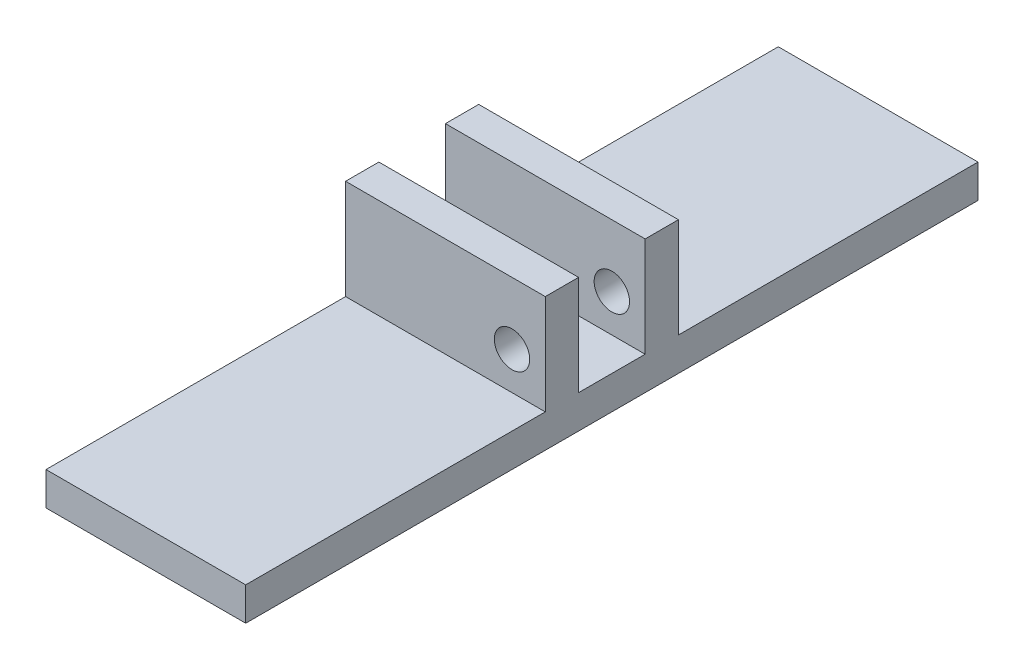
ISO-10303-21;
HEADER;
FILE_DESCRIPTION(('STEP AP214'),'2;1');
FILE_NAME('part.step','',(''),(''),'','','');
FILE_SCHEMA(('AUTOMOTIVE_DESIGN { 1 0 10303 214 1 1 1 1 }'));
ENDSEC;
DATA;
#1=APPLICATION_CONTEXT('core data for automotive mechanical design processes');
#2=APPLICATION_PROTOCOL_DEFINITION('international standard','automotive_design',2000,#1);
#3=PRODUCT_CONTEXT('',#1,'mechanical');
#4=PRODUCT('Part','Part','',(#3));
#5=PRODUCT_RELATED_PRODUCT_CATEGORY('part','',(#4));
#6=PRODUCT_DEFINITION_FORMATION('','',#4);
#7=PRODUCT_DEFINITION_CONTEXT('part definition',#1,'design');
#8=PRODUCT_DEFINITION('design','',#6,#7);
#9=PRODUCT_DEFINITION_SHAPE('','',#8);
#10=(LENGTH_UNIT() NAMED_UNIT(*) SI_UNIT(.MILLI.,.METRE.));
#11=(NAMED_UNIT(*) PLANE_ANGLE_UNIT() SI_UNIT($,.RADIAN.));
#12=(NAMED_UNIT(*) SI_UNIT($,.STERADIAN.) SOLID_ANGLE_UNIT());
#13=UNCERTAINTY_MEASURE_WITH_UNIT(LENGTH_MEASURE(1.E-05),#10,'distance_accuracy_value','');
#14=(GEOMETRIC_REPRESENTATION_CONTEXT(3) GLOBAL_UNCERTAINTY_ASSIGNED_CONTEXT((#13)) GLOBAL_UNIT_ASSIGNED_CONTEXT((#10,
#11,#12)) REPRESENTATION_CONTEXT('',''));
#15=CARTESIAN_POINT('',(0.,0.,0.));
#16=DIRECTION('',(0.,0.,1.));
#17=DIRECTION('',(1.,0.,0.));
#18=AXIS2_PLACEMENT_3D('',#15,#16,#17);
#19=CARTESIAN_POINT('',(38.1,6.35,69.85));
#20=DIRECTION('',(0.,0.,-1.));
#21=DIRECTION('',(-1.,0.,0.));
#22=AXIS2_PLACEMENT_3D('',#19,#20,#21);
#23=PLANE('',#22);
#24=DIRECTION('',(0.,-1.,0.));
#25=VECTOR('',#24,1.);
#26=CARTESIAN_POINT('',(0.,6.35,69.85));
#27=LINE('',#26,#25);
#28=CARTESIAN_POINT('',(0.,6.35,69.85));
#29=VERTEX_POINT('',#28);
#30=CARTESIAN_POINT('',(0.,0.,69.85));
#31=VERTEX_POINT('',#30);
#32=EDGE_CURVE('E154',#29,#31,#27,.T.);
#33=ORIENTED_EDGE('',*,*,#32,.T.);
#34=DIRECTION('',(-1.,0.,0.));
#35=VECTOR('',#34,1.);
#36=CARTESIAN_POINT('',(38.1,0.,69.85));
#37=LINE('',#36,#35);
#38=CARTESIAN_POINT('',(38.1,0.,69.85));
#39=VERTEX_POINT('',#38);
#40=EDGE_CURVE('E11',#39,#31,#37,.T.);
#41=ORIENTED_EDGE('',*,*,#40,.F.);
#42=DIRECTION('',(0.,-1.,0.));
#43=VECTOR('',#42,1.);
#44=CARTESIAN_POINT('',(38.1,6.35,69.85));
#45=LINE('',#44,#43);
#46=CARTESIAN_POINT('',(38.1,6.35,69.85));
#47=VERTEX_POINT('',#46);
#48=EDGE_CURVE('E177',#47,#39,#45,.T.);
#49=ORIENTED_EDGE('',*,*,#48,.F.);
#50=DIRECTION('',(-1.,0.,0.));
#51=VECTOR('',#50,1.);
#52=CARTESIAN_POINT('',(38.1,6.35,69.85));
#53=LINE('',#52,#51);
#54=EDGE_CURVE('E150',#47,#29,#53,.T.);
#55=ORIENTED_EDGE('',*,*,#54,.T.);
#56=EDGE_LOOP('',(#33,#41,#49,#55));
#57=FACE_BOUND('',#56,.T.);
#58=ADVANCED_FACE('F33',(#57),#23,.F.);
#59=CARTESIAN_POINT('',(38.1,0.,69.85));
#60=DIRECTION('',(0.,1.,0.));
#61=DIRECTION('',(0.,0.,1.));
#62=AXIS2_PLACEMENT_3D('',#59,#60,#61);
#63=PLANE('',#62);
#64=DIRECTION('',(0.,0.,-1.));
#65=VECTOR('',#64,1.);
#66=CARTESIAN_POINT('',(0.,0.,69.85));
#67=LINE('',#66,#65);
#68=CARTESIAN_POINT('',(0.,0.,-69.85));
#69=VERTEX_POINT('',#68);
#70=EDGE_CURVE('E157',#31,#69,#67,.T.);
#71=ORIENTED_EDGE('',*,*,#70,.T.);
#72=DIRECTION('',(-1.,0.,0.));
#73=VECTOR('',#72,1.);
#74=CARTESIAN_POINT('',(38.1,0.,-69.85));
#75=LINE('',#74,#73);
#76=CARTESIAN_POINT('',(38.1,0.,-69.85));
#77=VERTEX_POINT('',#76);
#78=EDGE_CURVE('E42',#77,#69,#75,.T.);
#79=ORIENTED_EDGE('',*,*,#78,.F.);
#80=DIRECTION('',(0.,0.,-1.));
#81=VECTOR('',#80,1.);
#82=CARTESIAN_POINT('',(38.1,0.,69.85));
#83=LINE('',#82,#81);
#84=EDGE_CURVE('E105',#39,#77,#83,.T.);
#85=ORIENTED_EDGE('',*,*,#84,.F.);
#86=ORIENTED_EDGE('',*,*,#40,.T.);
#87=EDGE_LOOP('',(#71,#79,#85,#86));
#88=FACE_BOUND('',#87,.T.);
#89=ADVANCED_FACE('F257',(#88),#63,.F.);
#90=CARTESIAN_POINT('',(38.1,0.,-69.85));
#91=DIRECTION('',(0.,0.,1.));
#92=DIRECTION('',(1.,0.,0.));
#93=AXIS2_PLACEMENT_3D('',#90,#91,#92);
#94=PLANE('',#93);
#95=DIRECTION('',(0.,1.,0.));
#96=VECTOR('',#95,1.);
#97=CARTESIAN_POINT('',(0.,0.,-69.85));
#98=LINE('',#97,#96);
#99=CARTESIAN_POINT('',(0.,6.35,-69.85));
#100=VERTEX_POINT('',#99);
#101=EDGE_CURVE('E160',#69,#100,#98,.T.);
#102=ORIENTED_EDGE('',*,*,#101,.T.);
#103=DIRECTION('',(-1.,0.,0.));
#104=VECTOR('',#103,1.);
#105=CARTESIAN_POINT('',(38.1,6.35,-69.85));
#106=LINE('',#105,#104);
#107=CARTESIAN_POINT('',(38.1,6.35,-69.85));
#108=VERTEX_POINT('',#107);
#109=EDGE_CURVE('E196',#108,#100,#106,.T.);
#110=ORIENTED_EDGE('',*,*,#109,.F.);
#111=DIRECTION('',(0.,1.,0.));
#112=VECTOR('',#111,1.);
#113=CARTESIAN_POINT('',(38.1,0.,-69.85));
#114=LINE('',#113,#112);
#115=EDGE_CURVE('E205',#77,#108,#114,.T.);
#116=ORIENTED_EDGE('',*,*,#115,.F.);
#117=ORIENTED_EDGE('',*,*,#78,.T.);
#118=EDGE_LOOP('',(#102,#110,#116,#117));
#119=FACE_BOUND('',#118,.T.);
#120=ADVANCED_FACE('F203',(#119),#94,.F.);
#121=CARTESIAN_POINT('',(38.1,6.35,-69.85));
#122=DIRECTION('',(0.,-1.,0.));
#123=DIRECTION('',(0.,0.,-1.));
#124=AXIS2_PLACEMENT_3D('',#121,#122,#123);
#125=PLANE('',#124);
#126=DIRECTION('',(0.,0.,1.));
#127=VECTOR('',#126,1.);
#128=CARTESIAN_POINT('',(0.,6.35,-69.85));
#129=LINE('',#128,#127);
#130=CARTESIAN_POINT('',(0.,6.34999999999999,-12.7));
#131=VERTEX_POINT('',#130);
#132=EDGE_CURVE('E162',#100,#131,#129,.T.);
#133=ORIENTED_EDGE('',*,*,#132,.T.);
#134=DIRECTION('',(-1.,0.,0.));
#135=VECTOR('',#134,1.);
#136=CARTESIAN_POINT('',(38.1,6.34999999999999,-12.7));
#137=LINE('',#136,#135);
#138=CARTESIAN_POINT('',(38.1,6.34999999999999,-12.7));
#139=VERTEX_POINT('',#138);
#140=EDGE_CURVE('E193',#139,#131,#137,.T.);
#141=ORIENTED_EDGE('',*,*,#140,.F.);
#142=DIRECTION('',(0.,0.,1.));
#143=VECTOR('',#142,1.);
#144=CARTESIAN_POINT('',(38.1,6.35,-69.85));
#145=LINE('',#144,#143);
#146=EDGE_CURVE('E223',#108,#139,#145,.T.);
#147=ORIENTED_EDGE('',*,*,#146,.F.);
#148=ORIENTED_EDGE('',*,*,#109,.T.);
#149=EDGE_LOOP('',(#133,#141,#147,#148));
#150=FACE_BOUND('',#149,.T.);
#151=ADVANCED_FACE('F214',(#150),#125,.F.);
#152=CARTESIAN_POINT('',(38.1,6.34999999999999,-12.7));
#153=DIRECTION('',(0.,0.,1.));
#154=DIRECTION('',(0.,-1.,0.));
#155=AXIS2_PLACEMENT_3D('',#152,#153,#154);
#156=PLANE('',#155);
#157=CARTESIAN_POINT('',(31.75,13.5255,-12.7));
#158=DIRECTION('',(0.,0.,1.));
#159=DIRECTION('',(0.,-1.,0.));
#160=AXIS2_PLACEMENT_3D('',#157,#158,#159);
#161=CIRCLE('',#160,3.37819999999999);
#162=CARTESIAN_POINT('',(31.75,10.1473,-12.7));
#163=VERTEX_POINT('',#162);
#164=EDGE_CURVE('E36',#163,#163,#161,.T.);
#165=ORIENTED_EDGE('',*,*,#164,.T.);
#166=EDGE_LOOP('',(#165));
#167=FACE_BOUND('',#166,.T.);
#168=DIRECTION('',(0.,1.,0.));
#169=VECTOR('',#168,1.);
#170=CARTESIAN_POINT('',(0.,6.34999999999999,-12.7));
#171=LINE('',#170,#169);
#172=CARTESIAN_POINT('',(0.,25.4,-12.7));
#173=VERTEX_POINT('',#172);
#174=EDGE_CURVE('E164',#131,#173,#171,.T.);
#175=ORIENTED_EDGE('',*,*,#174,.T.);
#176=DIRECTION('',(-1.,0.,0.));
#177=VECTOR('',#176,1.);
#178=CARTESIAN_POINT('',(38.1,25.4,-12.7));
#179=LINE('',#178,#177);
#180=CARTESIAN_POINT('',(38.1,25.4,-12.7));
#181=VERTEX_POINT('',#180);
#182=EDGE_CURVE('E190',#181,#173,#179,.T.);
#183=ORIENTED_EDGE('',*,*,#182,.F.);
#184=DIRECTION('',(0.,1.,0.));
#185=VECTOR('',#184,1.);
#186=CARTESIAN_POINT('',(38.1,6.34999999999999,-12.7));
#187=LINE('',#186,#185);
#188=EDGE_CURVE('E220',#139,#181,#187,.T.);
#189=ORIENTED_EDGE('',*,*,#188,.F.);
#190=ORIENTED_EDGE('',*,*,#140,.T.);
#191=EDGE_LOOP('',(#175,#183,#189,#190));
#192=FACE_BOUND('',#191,.T.);
#193=ADVANCED_FACE('F218',(#167,#192),#156,.F.);
#194=CARTESIAN_POINT('',(38.1,25.4,-12.7));
#195=DIRECTION('',(0.,-1.,0.));
#196=DIRECTION('',(0.,0.,-1.));
#197=AXIS2_PLACEMENT_3D('',#194,#195,#196);
#198=PLANE('',#197);
#199=DIRECTION('',(0.,0.,1.));
#200=VECTOR('',#199,1.);
#201=CARTESIAN_POINT('',(0.,25.4,-12.7));
#202=LINE('',#201,#200);
#203=CARTESIAN_POINT('',(0.,25.4,-6.35));
#204=VERTEX_POINT('',#203);
#205=EDGE_CURVE('E166',#173,#204,#202,.T.);
#206=ORIENTED_EDGE('',*,*,#205,.T.);
#207=DIRECTION('',(-1.,0.,0.));
#208=VECTOR('',#207,1.);
#209=CARTESIAN_POINT('',(38.1,25.4,-6.35));
#210=LINE('',#209,#208);
#211=CARTESIAN_POINT('',(38.1,25.4,-6.35));
#212=VERTEX_POINT('',#211);
#213=EDGE_CURVE('E187',#212,#204,#210,.T.);
#214=ORIENTED_EDGE('',*,*,#213,.F.);
#215=DIRECTION('',(0.,0.,1.));
#216=VECTOR('',#215,1.);
#217=CARTESIAN_POINT('',(38.1,25.4,-12.7));
#218=LINE('',#217,#216);
#219=EDGE_CURVE('E222',#181,#212,#218,.T.);
#220=ORIENTED_EDGE('',*,*,#219,.F.);
#221=ORIENTED_EDGE('',*,*,#182,.T.);
#222=EDGE_LOOP('',(#206,#214,#220,#221));
#223=FACE_BOUND('',#222,.T.);
#224=ADVANCED_FACE('F270',(#223),#198,.F.);
#225=CARTESIAN_POINT('',(38.1,25.4,-6.35));
#226=DIRECTION('',(0.,0.,-1.));
#227=DIRECTION('',(0.,1.,0.));
#228=AXIS2_PLACEMENT_3D('',#225,#226,#227);
#229=PLANE('',#228);
#230=CARTESIAN_POINT('',(31.75,13.5255,-6.35));
#231=DIRECTION('',(0.,0.,-1.));
#232=DIRECTION('',(0.,1.,0.));
#233=AXIS2_PLACEMENT_3D('',#230,#231,#232);
#234=CIRCLE('',#233,3.37819999999999);
#235=CARTESIAN_POINT('',(31.75,16.9037,-6.35));
#236=VERTEX_POINT('',#235);
#237=EDGE_CURVE('E158',#236,#236,#234,.T.);
#238=ORIENTED_EDGE('',*,*,#237,.T.);
#239=EDGE_LOOP('',(#238));
#240=FACE_BOUND('',#239,.T.);
#241=DIRECTION('',(0.,-1.,0.));
#242=VECTOR('',#241,1.);
#243=CARTESIAN_POINT('',(0.,25.4,-6.35));
#244=LINE('',#243,#242);
#245=CARTESIAN_POINT('',(0.,6.34999999999999,-6.35));
#246=VERTEX_POINT('',#245);
#247=EDGE_CURVE('E168',#204,#246,#244,.T.);
#248=ORIENTED_EDGE('',*,*,#247,.T.);
#249=DIRECTION('',(-1.,0.,0.));
#250=VECTOR('',#249,1.);
#251=CARTESIAN_POINT('',(38.1,6.34999999999999,-6.35));
#252=LINE('',#251,#250);
#253=CARTESIAN_POINT('',(38.1,6.34999999999999,-6.35));
#254=VERTEX_POINT('',#253);
#255=EDGE_CURVE('E184',#254,#246,#252,.T.);
#256=ORIENTED_EDGE('',*,*,#255,.F.);
#257=DIRECTION('',(0.,-1.,0.));
#258=VECTOR('',#257,1.);
#259=CARTESIAN_POINT('',(38.1,25.4,-6.35));
#260=LINE('',#259,#258);
#261=EDGE_CURVE('E225',#212,#254,#260,.T.);
#262=ORIENTED_EDGE('',*,*,#261,.F.);
#263=ORIENTED_EDGE('',*,*,#213,.T.);
#264=EDGE_LOOP('',(#248,#256,#262,#263));
#265=FACE_BOUND('',#264,.T.);
#266=ADVANCED_FACE('F274',(#240,#265),#229,.F.);
#267=CARTESIAN_POINT('',(38.1,6.34999999999999,-6.35));
#268=DIRECTION('',(0.,-1.,0.));
#269=DIRECTION('',(0.,0.,-1.));
#270=AXIS2_PLACEMENT_3D('',#267,#268,#269);
#271=PLANE('',#270);
#272=DIRECTION('',(0.,0.,1.));
#273=VECTOR('',#272,1.);
#274=CARTESIAN_POINT('',(0.,6.34999999999999,-6.35));
#275=LINE('',#274,#273);
#276=CARTESIAN_POINT('',(0.,6.34999999999999,6.35));
#277=VERTEX_POINT('',#276);
#278=EDGE_CURVE('E170',#246,#277,#275,.T.);
#279=ORIENTED_EDGE('',*,*,#278,.T.);
#280=DIRECTION('',(-1.,0.,0.));
#281=VECTOR('',#280,1.);
#282=CARTESIAN_POINT('',(38.1,6.34999999999999,6.35));
#283=LINE('',#282,#281);
#284=CARTESIAN_POINT('',(38.1,6.34999999999999,6.35));
#285=VERTEX_POINT('',#284);
#286=EDGE_CURVE('E181',#285,#277,#283,.T.);
#287=ORIENTED_EDGE('',*,*,#286,.F.);
#288=DIRECTION('',(0.,0.,1.));
#289=VECTOR('',#288,1.);
#290=CARTESIAN_POINT('',(38.1,6.34999999999999,-6.35));
#291=LINE('',#290,#289);
#292=EDGE_CURVE('E231',#254,#285,#291,.T.);
#293=ORIENTED_EDGE('',*,*,#292,.F.);
#294=ORIENTED_EDGE('',*,*,#255,.T.);
#295=EDGE_LOOP('',(#279,#287,#293,#294));
#296=FACE_BOUND('',#295,.T.);
#297=ADVANCED_FACE('F237',(#296),#271,.F.);
#298=CARTESIAN_POINT('',(38.1,6.34999999999999,6.35));
#299=DIRECTION('',(0.,0.,1.));
#300=DIRECTION('',(0.,-1.,0.));
#301=AXIS2_PLACEMENT_3D('',#298,#299,#300);
#302=PLANE('',#301);
#303=CARTESIAN_POINT('',(31.75,13.5255,6.35));
#304=DIRECTION('',(0.,0.,1.));
#305=DIRECTION('',(0.,-1.,0.));
#306=AXIS2_PLACEMENT_3D('',#303,#304,#305);
#307=CIRCLE('',#306,3.37819999999999);
#308=CARTESIAN_POINT('',(31.75,10.1473,6.35));
#309=VERTEX_POINT('',#308);
#310=EDGE_CURVE('E389',#309,#309,#307,.T.);
#311=ORIENTED_EDGE('',*,*,#310,.T.);
#312=EDGE_LOOP('',(#311));
#313=FACE_BOUND('',#312,.T.);
#314=DIRECTION('',(0.,1.,0.));
#315=VECTOR('',#314,1.);
#316=CARTESIAN_POINT('',(0.,6.34999999999999,6.35));
#317=LINE('',#316,#315);
#318=CARTESIAN_POINT('',(0.,25.4,6.35));
#319=VERTEX_POINT('',#318);
#320=EDGE_CURVE('E172',#277,#319,#317,.T.);
#321=ORIENTED_EDGE('',*,*,#320,.T.);
#322=DIRECTION('',(-1.,0.,0.));
#323=VECTOR('',#322,1.);
#324=CARTESIAN_POINT('',(38.1,25.4,6.35));
#325=LINE('',#324,#323);
#326=CARTESIAN_POINT('',(38.1,25.4,6.35));
#327=VERTEX_POINT('',#326);
#328=EDGE_CURVE('E145',#327,#319,#325,.T.);
#329=ORIENTED_EDGE('',*,*,#328,.F.);
#330=DIRECTION('',(0.,1.,0.));
#331=VECTOR('',#330,1.);
#332=CARTESIAN_POINT('',(38.1,6.34999999999999,6.35));
#333=LINE('',#332,#331);
#334=EDGE_CURVE('E136',#285,#327,#333,.T.);
#335=ORIENTED_EDGE('',*,*,#334,.F.);
#336=ORIENTED_EDGE('',*,*,#286,.T.);
#337=EDGE_LOOP('',(#321,#329,#335,#336));
#338=FACE_BOUND('',#337,.T.);
#339=ADVANCED_FACE('F241',(#313,#338),#302,.F.);
#340=CARTESIAN_POINT('',(38.1,25.4,6.35));
#341=DIRECTION('',(0.,-1.,0.));
#342=DIRECTION('',(0.,0.,-1.));
#343=AXIS2_PLACEMENT_3D('',#340,#341,#342);
#344=PLANE('',#343);
#345=DIRECTION('',(0.,0.,1.));
#346=VECTOR('',#345,1.);
#347=CARTESIAN_POINT('',(0.,25.4,6.35));
#348=LINE('',#347,#346);
#349=CARTESIAN_POINT('',(0.,25.4,12.7));
#350=VERTEX_POINT('',#349);
#351=EDGE_CURVE('E144',#319,#350,#348,.T.);
#352=ORIENTED_EDGE('',*,*,#351,.T.);
#353=DIRECTION('',(-1.,0.,0.));
#354=VECTOR('',#353,1.);
#355=CARTESIAN_POINT('',(38.1,25.4,12.7));
#356=LINE('',#355,#354);
#357=CARTESIAN_POINT('',(38.1,25.4,12.7));
#358=VERTEX_POINT('',#357);
#359=EDGE_CURVE('E141',#358,#350,#356,.T.);
#360=ORIENTED_EDGE('',*,*,#359,.F.);
#361=DIRECTION('',(0.,0.,1.));
#362=VECTOR('',#361,1.);
#363=CARTESIAN_POINT('',(38.1,25.4,6.35));
#364=LINE('',#363,#362);
#365=EDGE_CURVE('E130',#327,#358,#364,.T.);
#366=ORIENTED_EDGE('',*,*,#365,.F.);
#367=ORIENTED_EDGE('',*,*,#328,.T.);
#368=EDGE_LOOP('',(#352,#360,#366,#367));
#369=FACE_BOUND('',#368,.T.);
#370=ADVANCED_FACE('F142',(#369),#344,.F.);
#371=CARTESIAN_POINT('',(38.1,25.4,12.7));
#372=DIRECTION('',(0.,0.,-1.));
#373=DIRECTION('',(0.,1.,0.));
#374=AXIS2_PLACEMENT_3D('',#371,#372,#373);
#375=PLANE('',#374);
#376=CARTESIAN_POINT('',(31.75,13.5255,12.7));
#377=DIRECTION('',(0.,0.,1.));
#378=DIRECTION('',(1.,0.,0.));
#379=AXIS2_PLACEMENT_3D('',#376,#377,#378);
#380=CIRCLE('',#379,3.37819999999998);
#381=CARTESIAN_POINT('',(35.1282,13.5255,12.7));
#382=VERTEX_POINT('',#381);
#383=EDGE_CURVE('E386',#382,#382,#380,.T.);
#384=ORIENTED_EDGE('',*,*,#383,.F.);
#385=EDGE_LOOP('',(#384));
#386=FACE_BOUND('',#385,.T.);
#387=DIRECTION('',(0.,-1.,0.));
#388=VECTOR('',#387,1.);
#389=CARTESIAN_POINT('',(0.,25.4,12.7));
#390=LINE('',#389,#388);
#391=CARTESIAN_POINT('',(0.,6.34999999999999,12.7));
#392=VERTEX_POINT('',#391);
#393=EDGE_CURVE('E91',#350,#392,#390,.T.);
#394=ORIENTED_EDGE('',*,*,#393,.T.);
#395=DIRECTION('',(-1.,0.,0.));
#396=VECTOR('',#395,1.);
#397=CARTESIAN_POINT('',(38.1,6.34999999999999,12.7));
#398=LINE('',#397,#396);
#399=CARTESIAN_POINT('',(38.1,6.34999999999999,12.7));
#400=VERTEX_POINT('',#399);
#401=EDGE_CURVE('E146',#400,#392,#398,.T.);
#402=ORIENTED_EDGE('',*,*,#401,.F.);
#403=DIRECTION('',(0.,-1.,0.));
#404=VECTOR('',#403,1.);
#405=CARTESIAN_POINT('',(38.1,25.4,12.7));
#406=LINE('',#405,#404);
#407=EDGE_CURVE('E134',#358,#400,#406,.T.);
#408=ORIENTED_EDGE('',*,*,#407,.F.);
#409=ORIENTED_EDGE('',*,*,#359,.T.);
#410=EDGE_LOOP('',(#394,#402,#408,#409));
#411=FACE_BOUND('',#410,.T.);
#412=ADVANCED_FACE('F148',(#386,#411),#375,.F.);
#413=CARTESIAN_POINT('',(38.1,6.34999999999999,12.7));
#414=DIRECTION('',(0.,-1.,0.));
#415=DIRECTION('',(0.,0.,-1.));
#416=AXIS2_PLACEMENT_3D('',#413,#414,#415);
#417=PLANE('',#416);
#418=DIRECTION('',(0.,0.,1.));
#419=VECTOR('',#418,1.);
#420=CARTESIAN_POINT('',(0.,6.34999999999999,12.7));
#421=LINE('',#420,#419);
#422=EDGE_CURVE('E97',#392,#29,#421,.T.);
#423=ORIENTED_EDGE('',*,*,#422,.T.);
#424=ORIENTED_EDGE('',*,*,#54,.F.);
#425=DIRECTION('',(0.,0.,1.));
#426=VECTOR('',#425,1.);
#427=CARTESIAN_POINT('',(38.1,6.34999999999999,12.7));
#428=LINE('',#427,#426);
#429=EDGE_CURVE('E50',#400,#47,#428,.T.);
#430=ORIENTED_EDGE('',*,*,#429,.F.);
#431=ORIENTED_EDGE('',*,*,#401,.T.);
#432=EDGE_LOOP('',(#423,#424,#430,#431));
#433=FACE_BOUND('',#432,.T.);
#434=ADVANCED_FACE('F245',(#433),#417,.F.);
#435=CARTESIAN_POINT('',(38.1,0.,0.));
#436=DIRECTION('',(1.,0.,0.));
#437=DIRECTION('',(0.,0.,-1.));
#438=AXIS2_PLACEMENT_3D('',#435,#436,#437);
#439=PLANE('',#438);
#440=ORIENTED_EDGE('',*,*,#48,.T.);
#441=ORIENTED_EDGE('',*,*,#84,.T.);
#442=ORIENTED_EDGE('',*,*,#115,.T.);
#443=ORIENTED_EDGE('',*,*,#146,.T.);
#444=ORIENTED_EDGE('',*,*,#188,.T.);
#445=ORIENTED_EDGE('',*,*,#219,.T.);
#446=ORIENTED_EDGE('',*,*,#261,.T.);
#447=ORIENTED_EDGE('',*,*,#292,.T.);
#448=ORIENTED_EDGE('',*,*,#334,.T.);
#449=ORIENTED_EDGE('',*,*,#365,.T.);
#450=ORIENTED_EDGE('',*,*,#407,.T.);
#451=ORIENTED_EDGE('',*,*,#429,.T.);
#452=EDGE_LOOP('',(#440,#441,#442,#443,#444,#445,#446,#447,#448,#449,#450,#451));
#453=FACE_BOUND('',#452,.T.);
#454=ADVANCED_FACE('F132',(#453),#439,.T.);
#455=CARTESIAN_POINT('',(0.,0.,0.));
#456=DIRECTION('',(1.,0.,0.));
#457=DIRECTION('',(0.,0.,-1.));
#458=AXIS2_PLACEMENT_3D('',#455,#456,#457);
#459=PLANE('',#458);
#460=ORIENTED_EDGE('',*,*,#32,.F.);
#461=ORIENTED_EDGE('',*,*,#422,.F.);
#462=ORIENTED_EDGE('',*,*,#393,.F.);
#463=ORIENTED_EDGE('',*,*,#351,.F.);
#464=ORIENTED_EDGE('',*,*,#320,.F.);
#465=ORIENTED_EDGE('',*,*,#278,.F.);
#466=ORIENTED_EDGE('',*,*,#247,.F.);
#467=ORIENTED_EDGE('',*,*,#205,.F.);
#468=ORIENTED_EDGE('',*,*,#174,.F.);
#469=ORIENTED_EDGE('',*,*,#132,.F.);
#470=ORIENTED_EDGE('',*,*,#101,.F.);
#471=ORIENTED_EDGE('',*,*,#70,.F.);
#472=EDGE_LOOP('',(#460,#461,#462,#463,#464,#465,#466,#467,#468,#469,#470,#471));
#473=FACE_BOUND('',#472,.T.);
#474=ADVANCED_FACE('F209',(#473),#459,.F.);
#475=CARTESIAN_POINT('',(31.75,13.5255,12.7));
#476=DIRECTION('',(0.,0.,1.));
#477=DIRECTION('',(1.,0.,0.));
#478=AXIS2_PLACEMENT_3D('',#475,#476,#477);
#479=CYLINDRICAL_SURFACE('',#478,3.37819999999999);
#480=ORIENTED_EDGE('',*,*,#164,.F.);
#481=EDGE_LOOP('',(#480));
#482=FACE_BOUND('',#481,.T.);
#483=ORIENTED_EDGE('',*,*,#237,.F.);
#484=EDGE_LOOP('',(#483));
#485=FACE_BOUND('',#484,.T.);
#486=ADVANCED_FACE('F303',(#482,#485),#479,.F.);
#487=ORIENTED_EDGE('',*,*,#383,.T.);
#488=EDGE_LOOP('',(#487));
#489=FACE_BOUND('',#488,.T.);
#490=ORIENTED_EDGE('',*,*,#310,.F.);
#491=EDGE_LOOP('',(#490));
#492=FACE_BOUND('',#491,.T.);
#493=ADVANCED_FACE('F308',(#489,#492),#479,.F.);
#494=CLOSED_SHELL('',(#58,#89,#120,#151,#193,#224,#266,#297,#339,#370,#412,#434,#454,#474,#486,#493));
#495=MANIFOLD_SOLID_BREP('B2',#494);
#496=ADVANCED_BREP_SHAPE_REPRESENTATION('',(#18,#495),#14);
#497=SHAPE_DEFINITION_REPRESENTATION(#9,#496);
ENDSEC;
END-ISO-10303-21;
